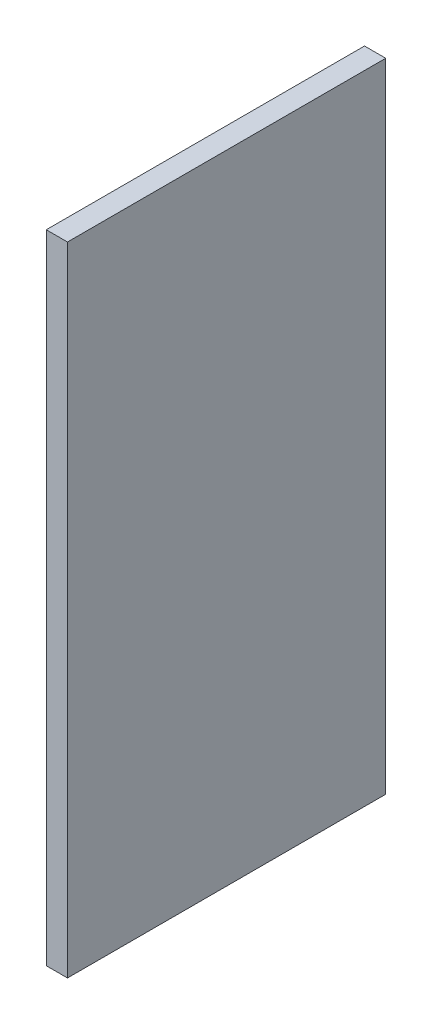
ISO-10303-21;
HEADER;
FILE_DESCRIPTION(('STEP AP214'),'2;1');
FILE_NAME('part.step','',(''),(''),'','','');
FILE_SCHEMA(('AUTOMOTIVE_DESIGN { 1 0 10303 214 1 1 1 1 }'));
ENDSEC;
DATA;
#1=APPLICATION_CONTEXT('core data for automotive mechanical design processes');
#2=APPLICATION_PROTOCOL_DEFINITION('international standard','automotive_design',2000,#1);
#3=PRODUCT_CONTEXT('',#1,'mechanical');
#4=PRODUCT('Part','Part','',(#3));
#5=PRODUCT_RELATED_PRODUCT_CATEGORY('part','',(#4));
#6=PRODUCT_DEFINITION_FORMATION('','',#4);
#7=PRODUCT_DEFINITION_CONTEXT('part definition',#1,'design');
#8=PRODUCT_DEFINITION('design','',#6,#7);
#9=PRODUCT_DEFINITION_SHAPE('','',#8);
#10=(LENGTH_UNIT() NAMED_UNIT(*) SI_UNIT(.MILLI.,.METRE.));
#11=(NAMED_UNIT(*) PLANE_ANGLE_UNIT() SI_UNIT($,.RADIAN.));
#12=(NAMED_UNIT(*) SI_UNIT($,.STERADIAN.) SOLID_ANGLE_UNIT());
#13=UNCERTAINTY_MEASURE_WITH_UNIT(LENGTH_MEASURE(1.E-05),#10,'distance_accuracy_value','');
#14=(GEOMETRIC_REPRESENTATION_CONTEXT(3) GLOBAL_UNCERTAINTY_ASSIGNED_CONTEXT((#13)) GLOBAL_UNIT_ASSIGNED_CONTEXT((#10,
#11,#12)) REPRESENTATION_CONTEXT('',''));
#15=CARTESIAN_POINT('',(0.,0.,0.));
#16=DIRECTION('',(0.,0.,1.));
#17=DIRECTION('',(1.,0.,0.));
#18=AXIS2_PLACEMENT_3D('',#15,#16,#17);
#19=CARTESIAN_POINT('',(97.5,-90.447346039,-10.));
#20=DIRECTION('',(-1.,0.,0.));
#21=DIRECTION('',(0.,0.,1.));
#22=AXIS2_PLACEMENT_3D('',#19,#20,#21);
#23=PLANE('',#22);
#24=DIRECTION('',(0.,1.,0.));
#25=VECTOR('',#24,1.);
#26=CARTESIAN_POINT('',(97.5,-60.405427183,20.));
#27=LINE('',#26,#25);
#28=CARTESIAN_POINT('',(97.5,-90.447346039,20.));
#29=VERTEX_POINT('',#28);
#30=CARTESIAN_POINT('',(97.5,-30.363508327,20.));
#31=VERTEX_POINT('',#30);
#32=EDGE_CURVE('E61',#29,#31,#27,.T.);
#33=ORIENTED_EDGE('',*,*,#32,.F.);
#34=DIRECTION('',(0.,0.,-1.));
#35=VECTOR('',#34,1.);
#36=CARTESIAN_POINT('',(97.5,-90.447346039,5.));
#37=LINE('',#36,#35);
#38=CARTESIAN_POINT('',(97.5,-90.447346039,-10.));
#39=VERTEX_POINT('',#38);
#40=EDGE_CURVE('E512',#29,#39,#37,.T.);
#41=ORIENTED_EDGE('',*,*,#40,.T.);
#42=DIRECTION('',(0.,-1.,0.));
#43=VECTOR('',#42,1.);
#44=CARTESIAN_POINT('',(97.5,-60.405427183,-10.));
#45=LINE('',#44,#43);
#46=CARTESIAN_POINT('',(97.5,-30.363508327,-10.));
#47=VERTEX_POINT('',#46);
#48=EDGE_CURVE('E64',#47,#39,#45,.T.);
#49=ORIENTED_EDGE('',*,*,#48,.F.);
#50=DIRECTION('',(0.,0.,-1.));
#51=VECTOR('',#50,1.);
#52=CARTESIAN_POINT('',(97.5,-30.363508327,5.));
#53=LINE('',#52,#51);
#54=EDGE_CURVE('E24',#31,#47,#53,.T.);
#55=ORIENTED_EDGE('',*,*,#54,.F.);
#56=EDGE_LOOP('',(#33,#41,#49,#55));
#57=FACE_BOUND('',#56,.T.);
#58=ADVANCED_FACE('F20',(#57),#23,.F.);
#59=CARTESIAN_POINT('',(95.5,-90.447346039,20.));
#60=DIRECTION('',(1.,0.,0.));
#61=DIRECTION('',(0.,0.,-1.));
#62=AXIS2_PLACEMENT_3D('',#59,#60,#61);
#63=PLANE('',#62);
#64=DIRECTION('',(0.,0.,-1.));
#65=VECTOR('',#64,1.);
#66=CARTESIAN_POINT('',(95.5,-90.447346039,5.));
#67=LINE('',#66,#65);
#68=CARTESIAN_POINT('',(95.5,-90.447346039,20.));
#69=VERTEX_POINT('',#68);
#70=CARTESIAN_POINT('',(95.5,-90.447346039,-10.));
#71=VERTEX_POINT('',#70);
#72=EDGE_CURVE('E32',#69,#71,#67,.T.);
#73=ORIENTED_EDGE('',*,*,#72,.F.);
#74=DIRECTION('',(0.,-1.,0.));
#75=VECTOR('',#74,1.);
#76=CARTESIAN_POINT('',(95.5,-60.405427183,20.));
#77=LINE('',#76,#75);
#78=CARTESIAN_POINT('',(95.5,-30.363508327,20.));
#79=VERTEX_POINT('',#78);
#80=EDGE_CURVE('E420',#79,#69,#77,.T.);
#81=ORIENTED_EDGE('',*,*,#80,.F.);
#82=DIRECTION('',(0.,0.,1.));
#83=VECTOR('',#82,1.);
#84=CARTESIAN_POINT('',(95.5,-30.363508327,5.));
#85=LINE('',#84,#83);
#86=CARTESIAN_POINT('',(95.5,-30.363508327,-10.));
#87=VERTEX_POINT('',#86);
#88=EDGE_CURVE('E81',#87,#79,#85,.T.);
#89=ORIENTED_EDGE('',*,*,#88,.F.);
#90=DIRECTION('',(0.,1.,0.));
#91=VECTOR('',#90,1.);
#92=CARTESIAN_POINT('',(95.5,-60.405427183,-10.));
#93=LINE('',#92,#91);
#94=EDGE_CURVE('E12',#71,#87,#93,.T.);
#95=ORIENTED_EDGE('',*,*,#94,.F.);
#96=EDGE_LOOP('',(#73,#81,#89,#95));
#97=FACE_BOUND('',#96,.T.);
#98=ADVANCED_FACE('F22',(#97),#63,.F.);
#99=CARTESIAN_POINT('',(95.5,-30.363508327,-10.));
#100=DIRECTION('',(0.,1.,0.));
#101=DIRECTION('',(0.,0.,1.));
#102=AXIS2_PLACEMENT_3D('',#99,#100,#101);
#103=PLANE('',#102);
#104=ORIENTED_EDGE('',*,*,#54,.T.);
#105=DIRECTION('',(1.,0.,0.));
#106=VECTOR('',#105,1.);
#107=CARTESIAN_POINT('',(96.5,-30.363508327,-10.));
#108=LINE('',#107,#106);
#109=EDGE_CURVE('E516',#87,#47,#108,.T.);
#110=ORIENTED_EDGE('',*,*,#109,.F.);
#111=ORIENTED_EDGE('',*,*,#88,.T.);
#112=DIRECTION('',(-1.,0.,0.));
#113=VECTOR('',#112,1.);
#114=CARTESIAN_POINT('',(96.5,-30.363508327,20.));
#115=LINE('',#114,#113);
#116=EDGE_CURVE('E70',#31,#79,#115,.T.);
#117=ORIENTED_EDGE('',*,*,#116,.F.);
#118=EDGE_LOOP('',(#104,#110,#111,#117));
#119=FACE_BOUND('',#118,.T.);
#120=ADVANCED_FACE('F80',(#119),#103,.T.);
#121=CARTESIAN_POINT('',(97.5,-30.363508327,20.));
#122=DIRECTION('',(0.,0.,1.));
#123=DIRECTION('',(-1.,0.,0.));
#124=AXIS2_PLACEMENT_3D('',#121,#122,#123);
#125=PLANE('',#124);
#126=DIRECTION('',(1.,0.,0.));
#127=VECTOR('',#126,1.);
#128=CARTESIAN_POINT('',(96.5,-90.447346039,20.));
#129=LINE('',#128,#127);
#130=EDGE_CURVE('E76',#69,#29,#129,.T.);
#131=ORIENTED_EDGE('',*,*,#130,.T.);
#132=ORIENTED_EDGE('',*,*,#32,.T.);
#133=ORIENTED_EDGE('',*,*,#116,.T.);
#134=ORIENTED_EDGE('',*,*,#80,.T.);
#135=EDGE_LOOP('',(#131,#132,#133,#134));
#136=FACE_BOUND('',#135,.T.);
#137=ADVANCED_FACE('F73',(#136),#125,.T.);
#138=CARTESIAN_POINT('',(95.5,-90.447346039,-10.));
#139=DIRECTION('',(0.,1.,0.));
#140=DIRECTION('',(0.,0.,1.));
#141=AXIS2_PLACEMENT_3D('',#138,#139,#140);
#142=PLANE('',#141);
#143=ORIENTED_EDGE('',*,*,#40,.F.);
#144=ORIENTED_EDGE('',*,*,#130,.F.);
#145=ORIENTED_EDGE('',*,*,#72,.T.);
#146=DIRECTION('',(-1.,0.,0.));
#147=VECTOR('',#146,1.);
#148=CARTESIAN_POINT('',(96.5,-90.447346039,-10.));
#149=LINE('',#148,#147);
#150=EDGE_CURVE('E40',#39,#71,#149,.T.);
#151=ORIENTED_EDGE('',*,*,#150,.F.);
#152=EDGE_LOOP('',(#143,#144,#145,#151));
#153=FACE_BOUND('',#152,.T.);
#154=ADVANCED_FACE('F806',(#153),#142,.F.);
#155=CARTESIAN_POINT('',(97.5,-90.447346039,-10.));
#156=DIRECTION('',(0.,0.,-1.));
#157=DIRECTION('',(-1.,0.,0.));
#158=AXIS2_PLACEMENT_3D('',#155,#156,#157);
#159=PLANE('',#158);
#160=ORIENTED_EDGE('',*,*,#48,.T.);
#161=ORIENTED_EDGE('',*,*,#150,.T.);
#162=ORIENTED_EDGE('',*,*,#94,.T.);
#163=ORIENTED_EDGE('',*,*,#109,.T.);
#164=EDGE_LOOP('',(#160,#161,#162,#163));
#165=FACE_BOUND('',#164,.T.);
#166=ADVANCED_FACE('F801',(#165),#159,.T.);
#167=CLOSED_SHELL('',(#58,#98,#120,#137,#154,#166));
#168=MANIFOLD_SOLID_BREP('B1',#167);
#169=ADVANCED_BREP_SHAPE_REPRESENTATION('',(#18,#168),#14);
#170=SHAPE_DEFINITION_REPRESENTATION(#9,#169);
ENDSEC;
END-ISO-10303-21;
